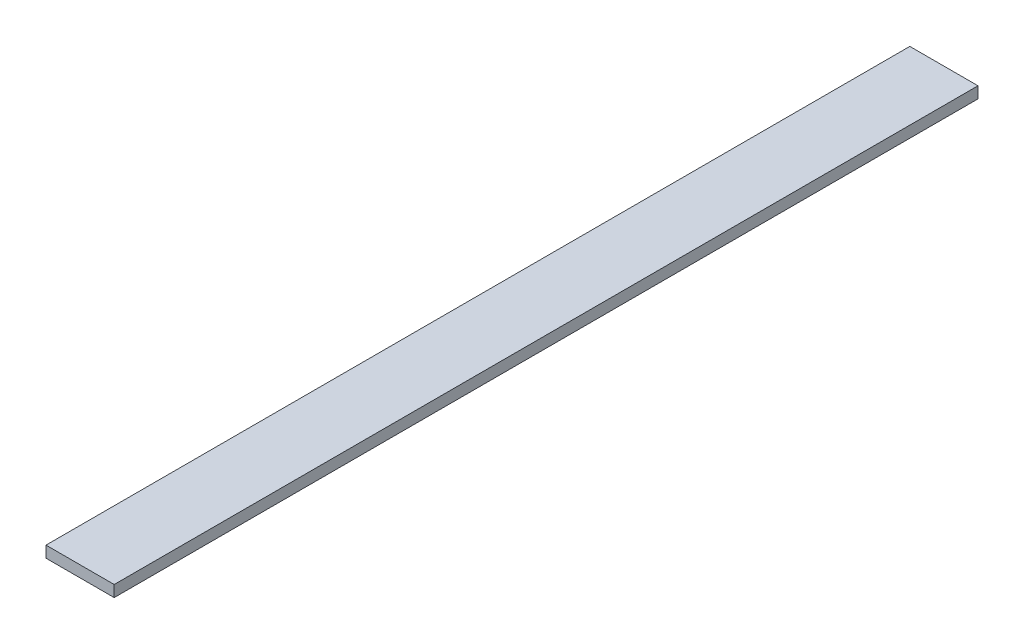
ISO-10303-21;
HEADER;
FILE_DESCRIPTION(('STEP AP214'),'2;1');
FILE_NAME('part.step','',(''),(''),'','','');
FILE_SCHEMA(('AUTOMOTIVE_DESIGN { 1 0 10303 214 1 1 1 1 }'));
ENDSEC;
DATA;
#1=APPLICATION_CONTEXT('core data for automotive mechanical design processes');
#2=APPLICATION_PROTOCOL_DEFINITION('international standard','automotive_design',2000,#1);
#3=PRODUCT_CONTEXT('',#1,'mechanical');
#4=PRODUCT('Part','Part','',(#3));
#5=PRODUCT_RELATED_PRODUCT_CATEGORY('part','',(#4));
#6=PRODUCT_DEFINITION_FORMATION('','',#4);
#7=PRODUCT_DEFINITION_CONTEXT('part definition',#1,'design');
#8=PRODUCT_DEFINITION('design','',#6,#7);
#9=PRODUCT_DEFINITION_SHAPE('','',#8);
#10=(LENGTH_UNIT() NAMED_UNIT(*) SI_UNIT(.MILLI.,.METRE.));
#11=(NAMED_UNIT(*) PLANE_ANGLE_UNIT() SI_UNIT($,.RADIAN.));
#12=(NAMED_UNIT(*) SI_UNIT($,.STERADIAN.) SOLID_ANGLE_UNIT());
#13=UNCERTAINTY_MEASURE_WITH_UNIT(LENGTH_MEASURE(1.E-05),#10,'distance_accuracy_value','');
#14=(GEOMETRIC_REPRESENTATION_CONTEXT(3) GLOBAL_UNCERTAINTY_ASSIGNED_CONTEXT((#13)) GLOBAL_UNIT_ASSIGNED_CONTEXT((#10,
#11,#12)) REPRESENTATION_CONTEXT('',''));
#15=CARTESIAN_POINT('',(0.,0.,0.));
#16=DIRECTION('',(0.,0.,1.));
#17=DIRECTION('',(1.,0.,0.));
#18=AXIS2_PLACEMENT_3D('',#15,#16,#17);
#19=CARTESIAN_POINT('',(0.,0.,241.3));
#20=DIRECTION('',(1.,0.,0.));
#21=DIRECTION('',(0.,0.,-1.));
#22=AXIS2_PLACEMENT_3D('',#19,#20,#21);
#23=PLANE('',#22);
#24=DIRECTION('',(0.,-1.,0.));
#25=VECTOR('',#24,1.);
#26=CARTESIAN_POINT('',(0.,0.,0.));
#27=LINE('',#26,#25);
#28=CARTESIAN_POINT('',(0.,3.175,0.));
#29=VERTEX_POINT('',#28);
#30=CARTESIAN_POINT('',(0.,0.,0.));
#31=VERTEX_POINT('',#30);
#32=EDGE_CURVE('E104',#29,#31,#27,.T.);
#33=ORIENTED_EDGE('',*,*,#32,.T.);
#34=DIRECTION('',(0.,0.,-1.));
#35=VECTOR('',#34,1.);
#36=CARTESIAN_POINT('',(0.,0.,241.3));
#37=LINE('',#36,#35);
#38=CARTESIAN_POINT('',(0.,0.,241.3));
#39=VERTEX_POINT('',#38);
#40=EDGE_CURVE('E11',#39,#31,#37,.T.);
#41=ORIENTED_EDGE('',*,*,#40,.F.);
#42=DIRECTION('',(0.,-1.,0.));
#43=VECTOR('',#42,1.);
#44=CARTESIAN_POINT('',(0.,0.,241.3));
#45=LINE('',#44,#43);
#46=CARTESIAN_POINT('',(0.,3.175,241.3));
#47=VERTEX_POINT('',#46);
#48=EDGE_CURVE('E92',#47,#39,#45,.T.);
#49=ORIENTED_EDGE('',*,*,#48,.F.);
#50=DIRECTION('',(0.,0.,-1.));
#51=VECTOR('',#50,1.);
#52=CARTESIAN_POINT('',(0.,3.175,241.3));
#53=LINE('',#52,#51);
#54=EDGE_CURVE('E100',#47,#29,#53,.T.);
#55=ORIENTED_EDGE('',*,*,#54,.T.);
#56=EDGE_LOOP('',(#33,#41,#49,#55));
#57=FACE_BOUND('',#56,.T.);
#58=ADVANCED_FACE('F41',(#57),#23,.F.);
#59=CARTESIAN_POINT('',(0.,0.,241.3));
#60=DIRECTION('',(0.,1.,0.));
#61=DIRECTION('',(0.,0.,1.));
#62=AXIS2_PLACEMENT_3D('',#59,#60,#61);
#63=PLANE('',#62);
#64=DIRECTION('',(1.,0.,0.));
#65=VECTOR('',#64,1.);
#66=CARTESIAN_POINT('',(0.,0.,0.));
#67=LINE('',#66,#65);
#68=CARTESIAN_POINT('',(19.05,0.,0.));
#69=VERTEX_POINT('',#68);
#70=EDGE_CURVE('E96',#31,#69,#67,.T.);
#71=ORIENTED_EDGE('',*,*,#70,.T.);
#72=DIRECTION('',(0.,0.,-1.));
#73=VECTOR('',#72,1.);
#74=CARTESIAN_POINT('',(19.05,0.,241.3));
#75=LINE('',#74,#73);
#76=CARTESIAN_POINT('',(19.05,0.,241.3));
#77=VERTEX_POINT('',#76);
#78=EDGE_CURVE('E49',#77,#69,#75,.T.);
#79=ORIENTED_EDGE('',*,*,#78,.F.);
#80=DIRECTION('',(1.,0.,0.));
#81=VECTOR('',#80,1.);
#82=CARTESIAN_POINT('',(0.,0.,241.3));
#83=LINE('',#82,#81);
#84=EDGE_CURVE('E87',#39,#77,#83,.T.);
#85=ORIENTED_EDGE('',*,*,#84,.F.);
#86=ORIENTED_EDGE('',*,*,#40,.T.);
#87=EDGE_LOOP('',(#71,#79,#85,#86));
#88=FACE_BOUND('',#87,.T.);
#89=ADVANCED_FACE('F95',(#88),#63,.F.);
#90=CARTESIAN_POINT('',(19.05,0.,241.3));
#91=DIRECTION('',(-1.,0.,0.));
#92=DIRECTION('',(0.,0.,1.));
#93=AXIS2_PLACEMENT_3D('',#90,#91,#92);
#94=PLANE('',#93);
#95=DIRECTION('',(0.,1.,0.));
#96=VECTOR('',#95,1.);
#97=CARTESIAN_POINT('',(19.05,0.,0.));
#98=LINE('',#97,#96);
#99=CARTESIAN_POINT('',(19.05,3.175,0.));
#100=VERTEX_POINT('',#99);
#101=EDGE_CURVE('E74',#69,#100,#98,.T.);
#102=ORIENTED_EDGE('',*,*,#101,.T.);
#103=DIRECTION('',(0.,0.,-1.));
#104=VECTOR('',#103,1.);
#105=CARTESIAN_POINT('',(19.05,3.175,241.3));
#106=LINE('',#105,#104);
#107=CARTESIAN_POINT('',(19.05,3.175,241.3));
#108=VERTEX_POINT('',#107);
#109=EDGE_CURVE('E97',#108,#100,#106,.T.);
#110=ORIENTED_EDGE('',*,*,#109,.F.);
#111=DIRECTION('',(0.,1.,0.));
#112=VECTOR('',#111,1.);
#113=CARTESIAN_POINT('',(19.05,0.,241.3));
#114=LINE('',#113,#112);
#115=EDGE_CURVE('E90',#77,#108,#114,.T.);
#116=ORIENTED_EDGE('',*,*,#115,.F.);
#117=ORIENTED_EDGE('',*,*,#78,.T.);
#118=EDGE_LOOP('',(#102,#110,#116,#117));
#119=FACE_BOUND('',#118,.T.);
#120=ADVANCED_FACE('F98',(#119),#94,.F.);
#121=CARTESIAN_POINT('',(0.,3.175,241.3));
#122=DIRECTION('',(0.,-1.,0.));
#123=DIRECTION('',(0.,0.,-1.));
#124=AXIS2_PLACEMENT_3D('',#121,#122,#123);
#125=PLANE('',#124);
#126=DIRECTION('',(-1.,0.,0.));
#127=VECTOR('',#126,1.);
#128=CARTESIAN_POINT('',(0.,3.175,0.));
#129=LINE('',#128,#127);
#130=EDGE_CURVE('E80',#100,#29,#129,.T.);
#131=ORIENTED_EDGE('',*,*,#130,.T.);
#132=ORIENTED_EDGE('',*,*,#54,.F.);
#133=DIRECTION('',(-1.,0.,0.));
#134=VECTOR('',#133,1.);
#135=CARTESIAN_POINT('',(0.,3.175,241.3));
#136=LINE('',#135,#134);
#137=EDGE_CURVE('E57',#108,#47,#136,.T.);
#138=ORIENTED_EDGE('',*,*,#137,.F.);
#139=ORIENTED_EDGE('',*,*,#109,.T.);
#140=EDGE_LOOP('',(#131,#132,#138,#139));
#141=FACE_BOUND('',#140,.T.);
#142=ADVANCED_FACE('F111',(#141),#125,.F.);
#143=CARTESIAN_POINT('',(0.,0.,241.3));
#144=DIRECTION('',(0.,0.,-1.));
#145=DIRECTION('',(-1.,0.,0.));
#146=AXIS2_PLACEMENT_3D('',#143,#144,#145);
#147=PLANE('',#146);
#148=ORIENTED_EDGE('',*,*,#48,.T.);
#149=ORIENTED_EDGE('',*,*,#84,.T.);
#150=ORIENTED_EDGE('',*,*,#115,.T.);
#151=ORIENTED_EDGE('',*,*,#137,.T.);
#152=EDGE_LOOP('',(#148,#149,#150,#151));
#153=FACE_BOUND('',#152,.T.);
#154=ADVANCED_FACE('F88',(#153),#147,.F.);
#155=CARTESIAN_POINT('',(0.,0.,0.));
#156=DIRECTION('',(0.,0.,-1.));
#157=DIRECTION('',(-1.,0.,0.));
#158=AXIS2_PLACEMENT_3D('',#155,#156,#157);
#159=PLANE('',#158);
#160=ORIENTED_EDGE('',*,*,#32,.F.);
#161=ORIENTED_EDGE('',*,*,#130,.F.);
#162=ORIENTED_EDGE('',*,*,#101,.F.);
#163=ORIENTED_EDGE('',*,*,#70,.F.);
#164=EDGE_LOOP('',(#160,#161,#162,#163));
#165=FACE_BOUND('',#164,.T.);
#166=ADVANCED_FACE('F114',(#165),#159,.T.);
#167=CLOSED_SHELL('',(#58,#89,#120,#142,#154,#166));
#168=MANIFOLD_SOLID_BREP('B2',#167);
#169=ADVANCED_BREP_SHAPE_REPRESENTATION('',(#18,#168),#14);
#170=SHAPE_DEFINITION_REPRESENTATION(#9,#169);
ENDSEC;
END-ISO-10303-21;
